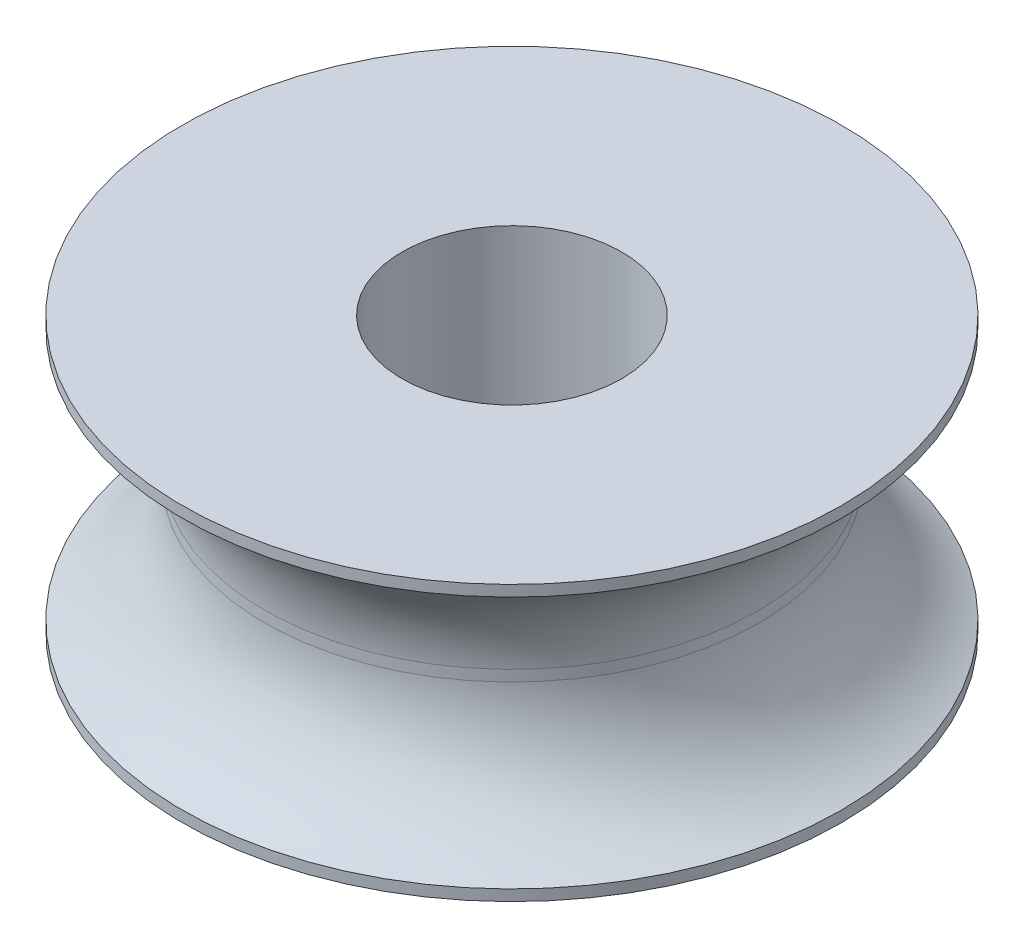
ISO-10303-21;
HEADER;
FILE_DESCRIPTION(('STEP AP214'),'2;1');
FILE_NAME('part.step','',(''),(''),'','','');
FILE_SCHEMA(('AUTOMOTIVE_DESIGN { 1 0 10303 214 1 1 1 1 }'));
ENDSEC;
DATA;
#1=APPLICATION_CONTEXT('core data for automotive mechanical design processes');
#2=APPLICATION_PROTOCOL_DEFINITION('international standard','automotive_design',2000,#1);
#3=PRODUCT_CONTEXT('',#1,'mechanical');
#4=PRODUCT('Part','Part','',(#3));
#5=PRODUCT_RELATED_PRODUCT_CATEGORY('part','',(#4));
#6=PRODUCT_DEFINITION_FORMATION('','',#4);
#7=PRODUCT_DEFINITION_CONTEXT('part definition',#1,'design');
#8=PRODUCT_DEFINITION('design','',#6,#7);
#9=PRODUCT_DEFINITION_SHAPE('','',#8);
#10=(LENGTH_UNIT() NAMED_UNIT(*) SI_UNIT(.MILLI.,.METRE.));
#11=(NAMED_UNIT(*) PLANE_ANGLE_UNIT() SI_UNIT($,.RADIAN.));
#12=(NAMED_UNIT(*) SI_UNIT($,.STERADIAN.) SOLID_ANGLE_UNIT());
#13=UNCERTAINTY_MEASURE_WITH_UNIT(LENGTH_MEASURE(1.E-05),#10,'distance_accuracy_value','');
#14=(GEOMETRIC_REPRESENTATION_CONTEXT(3) GLOBAL_UNCERTAINTY_ASSIGNED_CONTEXT((#13)) GLOBAL_UNIT_ASSIGNED_CONTEXT((#10,
#11,#12)) REPRESENTATION_CONTEXT('',''));
#15=CARTESIAN_POINT('',(0.,0.,0.));
#16=DIRECTION('',(0.,0.,1.));
#17=DIRECTION('',(1.,0.,0.));
#18=AXIS2_PLACEMENT_3D('',#15,#16,#17);
#19=CARTESIAN_POINT('',(0.,-2.5,0.));
#20=DIRECTION('',(0.,-1.,0.));
#21=DIRECTION('',(1.,0.,0.));
#22=AXIS2_PLACEMENT_3D('',#19,#20,#21);
#23=CYLINDRICAL_SURFACE('',#22,6.);
#24=CARTESIAN_POINT('',(0.,2.5,0.));
#25=DIRECTION('',(0.,-1.,0.));
#26=DIRECTION('',(1.,0.,0.));
#27=AXIS2_PLACEMENT_3D('',#24,#25,#26);
#28=CIRCLE('',#27,6.);
#29=CARTESIAN_POINT('',(6.,2.5,0.));
#30=VERTEX_POINT('',#29);
#31=EDGE_CURVE('E10',#30,#30,#28,.T.);
#32=ORIENTED_EDGE('',*,*,#31,.T.);
#33=EDGE_LOOP('',(#32));
#34=FACE_BOUND('',#33,.T.);
#35=CARTESIAN_POINT('',(0.,2.3,0.));
#36=DIRECTION('',(0.,-1.,0.));
#37=DIRECTION('',(1.,0.,0.));
#38=AXIS2_PLACEMENT_3D('',#35,#36,#37);
#39=CIRCLE('',#38,6.);
#40=CARTESIAN_POINT('',(6.,2.3,0.));
#41=VERTEX_POINT('',#40);
#42=EDGE_CURVE('E58',#41,#41,#39,.T.);
#43=ORIENTED_EDGE('',*,*,#42,.F.);
#44=EDGE_LOOP('',(#43));
#45=FACE_BOUND('',#44,.T.);
#46=ADVANCED_FACE('F30',(#34,#45),#23,.T.);
#47=CARTESIAN_POINT('',(2.,2.5,0.));
#48=DIRECTION('',(0.,1.,0.));
#49=DIRECTION('',(-1.,0.,0.));
#50=AXIS2_PLACEMENT_3D('',#47,#48,#49);
#51=PLANE('',#50);
#52=CARTESIAN_POINT('',(0.,2.5,0.));
#53=DIRECTION('',(0.,-1.,0.));
#54=DIRECTION('',(1.,0.,0.));
#55=AXIS2_PLACEMENT_3D('',#52,#53,#54);
#56=CIRCLE('',#55,2.);
#57=CARTESIAN_POINT('',(2.,2.5,0.));
#58=VERTEX_POINT('',#57);
#59=EDGE_CURVE('E36',#58,#58,#56,.T.);
#60=ORIENTED_EDGE('',*,*,#59,.T.);
#61=EDGE_LOOP('',(#60));
#62=FACE_BOUND('',#61,.T.);
#63=ORIENTED_EDGE('',*,*,#31,.F.);
#64=EDGE_LOOP('',(#63));
#65=FACE_BOUND('',#64,.T.);
#66=ADVANCED_FACE('F66',(#62,#65),#51,.T.);
#67=CARTESIAN_POINT('',(0.,-2.5,0.));
#68=DIRECTION('',(0.,-1.,0.));
#69=DIRECTION('',(1.,0.,0.));
#70=AXIS2_PLACEMENT_3D('',#67,#68,#69);
#71=CYLINDRICAL_SURFACE('',#70,2.);
#72=CARTESIAN_POINT('',(0.,-2.5,0.));
#73=DIRECTION('',(0.,-1.,0.));
#74=DIRECTION('',(1.,0.,0.));
#75=AXIS2_PLACEMENT_3D('',#72,#73,#74);
#76=CIRCLE('',#75,2.);
#77=CARTESIAN_POINT('',(2.,-2.5,0.));
#78=VERTEX_POINT('',#77);
#79=EDGE_CURVE('E40',#78,#78,#76,.T.);
#80=ORIENTED_EDGE('',*,*,#79,.T.);
#81=EDGE_LOOP('',(#80));
#82=FACE_BOUND('',#81,.T.);
#83=ORIENTED_EDGE('',*,*,#59,.F.);
#84=EDGE_LOOP('',(#83));
#85=FACE_BOUND('',#84,.T.);
#86=ADVANCED_FACE('F70',(#82,#85),#71,.F.);
#87=CARTESIAN_POINT('',(2.,-2.5,0.));
#88=DIRECTION('',(0.,-1.,0.));
#89=DIRECTION('',(1.,0.,0.));
#90=AXIS2_PLACEMENT_3D('',#87,#88,#89);
#91=PLANE('',#90);
#92=CARTESIAN_POINT('',(0.,-2.5,0.));
#93=DIRECTION('',(0.,-1.,0.));
#94=DIRECTION('',(1.,0.,0.));
#95=AXIS2_PLACEMENT_3D('',#92,#93,#94);
#96=CIRCLE('',#95,6.);
#97=CARTESIAN_POINT('',(6.,-2.5,0.));
#98=VERTEX_POINT('',#97);
#99=EDGE_CURVE('E44',#98,#98,#96,.T.);
#100=ORIENTED_EDGE('',*,*,#99,.T.);
#101=EDGE_LOOP('',(#100));
#102=FACE_BOUND('',#101,.T.);
#103=ORIENTED_EDGE('',*,*,#79,.F.);
#104=EDGE_LOOP('',(#103));
#105=FACE_BOUND('',#104,.T.);
#106=ADVANCED_FACE('F74',(#102,#105),#91,.T.);
#107=CARTESIAN_POINT('',(0.,-2.5,0.));
#108=DIRECTION('',(0.,-1.,0.));
#109=DIRECTION('',(1.,0.,0.));
#110=AXIS2_PLACEMENT_3D('',#107,#108,#109);
#111=CYLINDRICAL_SURFACE('',#110,6.);
#112=CARTESIAN_POINT('',(0.,-2.3,0.));
#113=DIRECTION('',(0.,-1.,0.));
#114=DIRECTION('',(1.,0.,0.));
#115=AXIS2_PLACEMENT_3D('',#112,#113,#114);
#116=CIRCLE('',#115,6.);
#117=CARTESIAN_POINT('',(6.,-2.3,0.));
#118=VERTEX_POINT('',#117);
#119=EDGE_CURVE('E49',#118,#118,#116,.T.);
#120=ORIENTED_EDGE('',*,*,#119,.T.);
#121=EDGE_LOOP('',(#120));
#122=FACE_BOUND('',#121,.T.);
#123=ORIENTED_EDGE('',*,*,#99,.F.);
#124=EDGE_LOOP('',(#123));
#125=FACE_BOUND('',#124,.T.);
#126=ADVANCED_FACE('F81',(#122,#125),#111,.T.);
#127=CARTESIAN_POINT('',(0.,0.00324858757062352,0.));
#128=DIRECTION('',(0.,-1.,0.));
#129=DIRECTION('',(1.,0.,0.));
#130=AXIS2_PLACEMENT_3D('',#127,#128,#129);
#131=TOROIDAL_SURFACE('',#130,7.01476459510358,2.51688323917138);
#132=CARTESIAN_POINT('',(0.,-0.099999999999999,0.));
#133=DIRECTION('',(0.,-1.,0.));
#134=DIRECTION('',(1.,0.,0.));
#135=AXIS2_PLACEMENT_3D('',#132,#133,#134);
#136=CIRCLE('',#135,4.5);
#137=CARTESIAN_POINT('',(4.5,-0.0999999999999981,0.));
#138=VERTEX_POINT('',#137);
#139=EDGE_CURVE('E52',#138,#138,#136,.T.);
#140=ORIENTED_EDGE('',*,*,#139,.T.);
#141=EDGE_LOOP('',(#140));
#142=FACE_BOUND('',#141,.T.);
#143=ORIENTED_EDGE('',*,*,#119,.F.);
#144=EDGE_LOOP('',(#143));
#145=FACE_BOUND('',#144,.T.);
#146=ADVANCED_FACE('F85',(#142,#145),#131,.F.);
#147=CARTESIAN_POINT('',(0.,-2.5,0.));
#148=DIRECTION('',(0.,-1.,0.));
#149=DIRECTION('',(1.,0.,0.));
#150=AXIS2_PLACEMENT_3D('',#147,#148,#149);
#151=CYLINDRICAL_SURFACE('',#150,4.5);
#152=CARTESIAN_POINT('',(0.,0.100000000000001,0.));
#153=DIRECTION('',(0.,-1.,0.));
#154=DIRECTION('',(1.,0.,0.));
#155=AXIS2_PLACEMENT_3D('',#152,#153,#154);
#156=CIRCLE('',#155,4.5);
#157=CARTESIAN_POINT('',(4.5,0.100000000000002,0.));
#158=VERTEX_POINT('',#157);
#159=EDGE_CURVE('E55',#158,#158,#156,.T.);
#160=ORIENTED_EDGE('',*,*,#159,.T.);
#161=EDGE_LOOP('',(#160));
#162=FACE_BOUND('',#161,.T.);
#163=ORIENTED_EDGE('',*,*,#139,.F.);
#164=EDGE_LOOP('',(#163));
#165=FACE_BOUND('',#164,.T.);
#166=ADVANCED_FACE('F89',(#162,#165),#151,.T.);
#167=CARTESIAN_POINT('',(0.,-0.00324858757062233,0.));
#168=DIRECTION('',(0.,-1.,0.));
#169=DIRECTION('',(1.,0.,0.));
#170=AXIS2_PLACEMENT_3D('',#167,#168,#169);
#171=TOROIDAL_SURFACE('',#170,7.01476459510358,2.51688323917138);
#172=ORIENTED_EDGE('',*,*,#42,.T.);
#173=EDGE_LOOP('',(#172));
#174=FACE_BOUND('',#173,.T.);
#175=ORIENTED_EDGE('',*,*,#159,.F.);
#176=EDGE_LOOP('',(#175));
#177=FACE_BOUND('',#176,.T.);
#178=ADVANCED_FACE('F62',(#174,#177),#171,.F.);
#179=CLOSED_SHELL('',(#46,#66,#86,#106,#126,#146,#166,#178));
#180=MANIFOLD_SOLID_BREP('B2',#179);
#181=ADVANCED_BREP_SHAPE_REPRESENTATION('',(#18,#180),#14);
#182=SHAPE_DEFINITION_REPRESENTATION(#9,#181);
ENDSEC;
END-ISO-10303-21;
